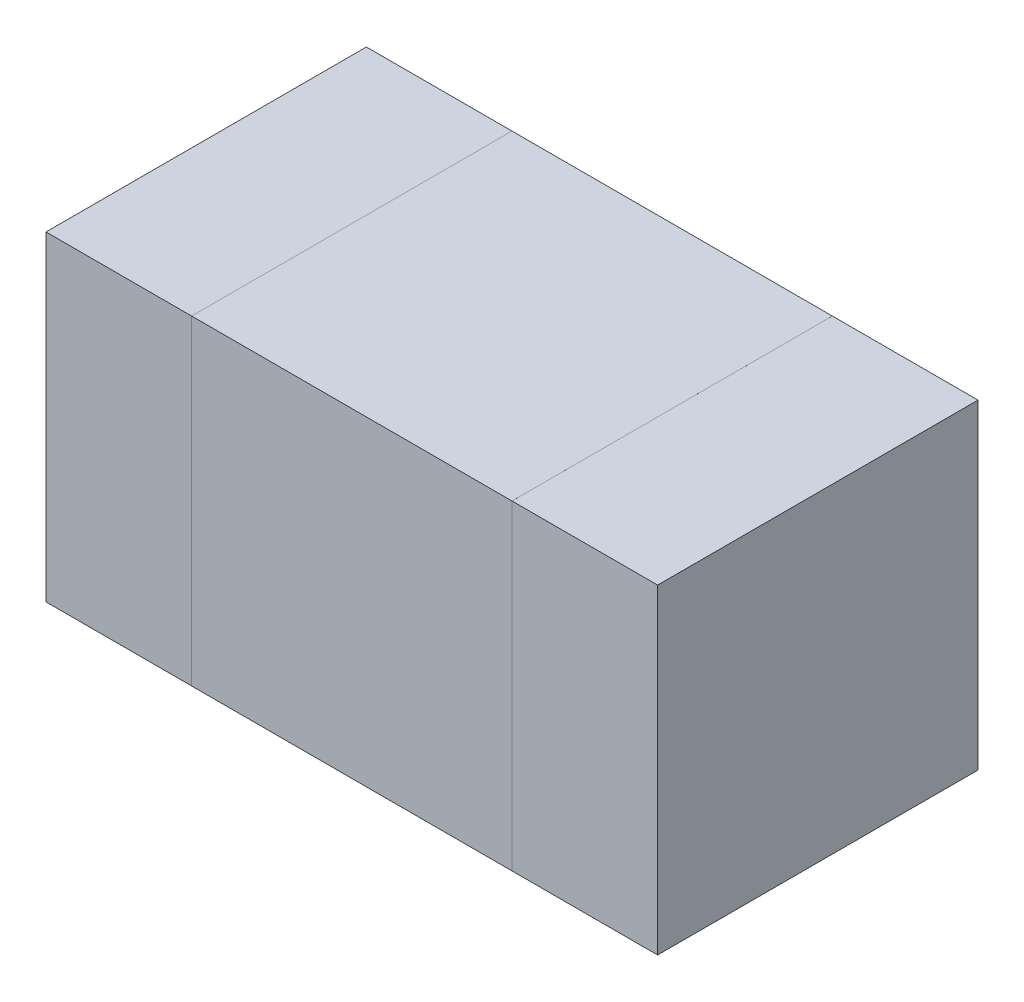
ISO-10303-21;
HEADER;
FILE_DESCRIPTION(('STEP AP214'),'2;1');
FILE_NAME('part.step','',(''),(''),'','','');
FILE_SCHEMA(('AUTOMOTIVE_DESIGN { 1 0 10303 214 1 1 1 1 }'));
ENDSEC;
DATA;
#1=APPLICATION_CONTEXT('core data for automotive mechanical design processes');
#2=APPLICATION_PROTOCOL_DEFINITION('international standard','automotive_design',2000,#1);
#3=PRODUCT_CONTEXT('',#1,'mechanical');
#4=PRODUCT('Part','Part','',(#3));
#5=PRODUCT_RELATED_PRODUCT_CATEGORY('part','',(#4));
#6=PRODUCT_DEFINITION_FORMATION('','',#4);
#7=PRODUCT_DEFINITION_CONTEXT('part definition',#1,'design');
#8=PRODUCT_DEFINITION('design','',#6,#7);
#9=PRODUCT_DEFINITION_SHAPE('','',#8);
#10=(LENGTH_UNIT() NAMED_UNIT(*) SI_UNIT(.MILLI.,.METRE.));
#11=(NAMED_UNIT(*) PLANE_ANGLE_UNIT() SI_UNIT($,.RADIAN.));
#12=(NAMED_UNIT(*) SI_UNIT($,.STERADIAN.) SOLID_ANGLE_UNIT());
#13=UNCERTAINTY_MEASURE_WITH_UNIT(LENGTH_MEASURE(1.E-05),#10,'distance_accuracy_value','');
#14=(GEOMETRIC_REPRESENTATION_CONTEXT(3) GLOBAL_UNCERTAINTY_ASSIGNED_CONTEXT((#13)) GLOBAL_UNIT_ASSIGNED_CONTEXT((#10,
#11,#12)) REPRESENTATION_CONTEXT('',''));
#15=CARTESIAN_POINT('',(0.,0.,0.));
#16=DIRECTION('',(0.,0.,1.));
#17=DIRECTION('',(1.,0.,0.));
#18=AXIS2_PLACEMENT_3D('',#15,#16,#17);
#19=CARTESIAN_POINT('',(1.000005241211,9.859997420195,0.32999934));
#20=DIRECTION('',(0.,0.,-1.));
#21=DIRECTION('',(0.,-1.,0.));
#22=AXIS2_PLACEMENT_3D('',#19,#20,#21);
#23=PLANE('',#22);
#24=DIRECTION('',(0.,1.,0.));
#25=VECTOR('',#24,1.);
#26=CARTESIAN_POINT('',(1.000005241211,9.859997420195,0.32999934));
#27=LINE('',#26,#25);
#28=CARTESIAN_POINT('',(1.000005241211,9.859997420195,0.32999934));
#29=VERTEX_POINT('',#28);
#30=CARTESIAN_POINT('',(1.000005241211,10.189999300195,0.32999934));
#31=VERTEX_POINT('',#30);
#32=EDGE_CURVE('P0_E82',#29,#31,#27,.T.);
#33=ORIENTED_EDGE('',*,*,#32,.T.);
#34=DIRECTION('',(-1.,0.,0.));
#35=VECTOR('',#34,1.);
#36=CARTESIAN_POINT('',(1.000005241211,10.189999300195,0.32999934));
#37=LINE('',#36,#35);
#38=CARTESIAN_POINT('',(0.850003001211,10.189999300195,0.32999934));
#39=VERTEX_POINT('',#38);
#40=EDGE_CURVE('P0_E105',#31,#39,#37,.T.);
#41=ORIENTED_EDGE('',*,*,#40,.T.);
#42=DIRECTION('',(0.,-1.,0.));
#43=VECTOR('',#42,1.);
#44=CARTESIAN_POINT('',(0.850003001211,10.189999300195,0.32999934));
#45=LINE('',#44,#43);
#46=CARTESIAN_POINT('',(0.850003001211,9.859997420195,0.32999934));
#47=VERTEX_POINT('',#46);
#48=EDGE_CURVE('P0_E75',#39,#47,#45,.T.);
#49=ORIENTED_EDGE('',*,*,#48,.T.);
#50=DIRECTION('',(1.,0.,0.));
#51=VECTOR('',#50,1.);
#52=CARTESIAN_POINT('',(0.850003001211,9.859997420195,0.32999934));
#53=LINE('',#52,#51);
#54=EDGE_CURVE('P0_E11',#47,#29,#53,.T.);
#55=ORIENTED_EDGE('',*,*,#54,.T.);
#56=EDGE_LOOP('',(#33,#41,#49,#55));
#57=FACE_BOUND('',#56,.T.);
#58=ADVANCED_FACE('P0_F17',(#57),#23,.F.);
#59=CARTESIAN_POINT('',(1.000005241211,9.859997420195,0.));
#60=DIRECTION('',(0.,0.,-1.));
#61=DIRECTION('',(0.,-1.,0.));
#62=AXIS2_PLACEMENT_3D('',#59,#60,#61);
#63=PLANE('',#62);
#64=DIRECTION('',(1.,0.,0.));
#65=VECTOR('',#64,1.);
#66=CARTESIAN_POINT('',(0.850003001211,9.859997420195,0.));
#67=LINE('',#66,#65);
#68=CARTESIAN_POINT('',(0.850003001211,9.859997420195,0.));
#69=VERTEX_POINT('',#68);
#70=CARTESIAN_POINT('',(1.000005241211,9.859997420195,0.));
#71=VERTEX_POINT('',#70);
#72=EDGE_CURVE('P0_E26',#69,#71,#67,.T.);
#73=ORIENTED_EDGE('',*,*,#72,.F.);
#74=DIRECTION('',(0.,-1.,0.));
#75=VECTOR('',#74,1.);
#76=CARTESIAN_POINT('',(0.850003001211,10.189999300195,0.));
#77=LINE('',#76,#75);
#78=CARTESIAN_POINT('',(0.850003001211,10.189999300195,0.));
#79=VERTEX_POINT('',#78);
#80=EDGE_CURVE('P0_E109',#79,#69,#77,.T.);
#81=ORIENTED_EDGE('',*,*,#80,.F.);
#82=DIRECTION('',(-1.,0.,0.));
#83=VECTOR('',#82,1.);
#84=CARTESIAN_POINT('',(1.000005241211,10.189999300195,0.));
#85=LINE('',#84,#83);
#86=CARTESIAN_POINT('',(1.000005241211,10.189999300195,0.));
#87=VERTEX_POINT('',#86);
#88=EDGE_CURVE('P0_E84',#87,#79,#85,.T.);
#89=ORIENTED_EDGE('',*,*,#88,.F.);
#90=DIRECTION('',(0.,1.,0.));
#91=VECTOR('',#90,1.);
#92=CARTESIAN_POINT('',(1.000005241211,9.859997420195,0.));
#93=LINE('',#92,#91);
#94=EDGE_CURVE('P0_E80',#71,#87,#93,.T.);
#95=ORIENTED_EDGE('',*,*,#94,.F.);
#96=EDGE_LOOP('',(#73,#81,#89,#95));
#97=FACE_BOUND('',#96,.T.);
#98=ADVANCED_FACE('P0_F19',(#97),#63,.T.);
#99=CARTESIAN_POINT('',(0.850003001211,9.859997420195,0.));
#100=DIRECTION('',(0.,1.,0.));
#101=DIRECTION('',(1.,0.,0.));
#102=AXIS2_PLACEMENT_3D('',#99,#100,#101);
#103=PLANE('',#102);
#104=ORIENTED_EDGE('',*,*,#72,.T.);
#105=DIRECTION('',(0.,0.,1.));
#106=VECTOR('',#105,1.);
#107=CARTESIAN_POINT('',(1.000005241211,9.859997420195,0.));
#108=LINE('',#107,#106);
#109=EDGE_CURVE('P0_E69',#71,#29,#108,.T.);
#110=ORIENTED_EDGE('',*,*,#109,.T.);
#111=ORIENTED_EDGE('',*,*,#54,.F.);
#112=DIRECTION('',(0.,0.,1.));
#113=VECTOR('',#112,1.);
#114=CARTESIAN_POINT('',(0.850003001211,9.859997420195,0.));
#115=LINE('',#114,#113);
#116=EDGE_CURVE('P0_E72',#69,#47,#115,.T.);
#117=ORIENTED_EDGE('',*,*,#116,.F.);
#118=EDGE_LOOP('',(#104,#110,#111,#117));
#119=FACE_BOUND('',#118,.T.);
#120=ADVANCED_FACE('P0_F68',(#119),#103,.F.);
#121=CARTESIAN_POINT('',(0.850003001211,10.189999300195,0.));
#122=DIRECTION('',(1.,0.,0.));
#123=DIRECTION('',(0.,1.,0.));
#124=AXIS2_PLACEMENT_3D('',#121,#122,#123);
#125=PLANE('',#124);
#126=ORIENTED_EDGE('',*,*,#80,.T.);
#127=ORIENTED_EDGE('',*,*,#116,.T.);
#128=ORIENTED_EDGE('',*,*,#48,.F.);
#129=DIRECTION('',(0.,0.,1.));
#130=VECTOR('',#129,1.);
#131=CARTESIAN_POINT('',(0.850003001211,10.189999300195,0.));
#132=LINE('',#131,#130);
#133=EDGE_CURVE('P0_E101',#79,#39,#132,.T.);
#134=ORIENTED_EDGE('',*,*,#133,.F.);
#135=EDGE_LOOP('',(#126,#127,#128,#134));
#136=FACE_BOUND('',#135,.T.);
#137=ADVANCED_FACE('P0_F116',(#136),#125,.F.);
#138=CARTESIAN_POINT('',(1.000005241211,10.189999300195,0.));
#139=DIRECTION('',(0.,-1.,0.));
#140=DIRECTION('',(0.,0.,-1.));
#141=AXIS2_PLACEMENT_3D('',#138,#139,#140);
#142=PLANE('',#141);
#143=ORIENTED_EDGE('',*,*,#88,.T.);
#144=ORIENTED_EDGE('',*,*,#133,.T.);
#145=ORIENTED_EDGE('',*,*,#40,.F.);
#146=DIRECTION('',(0.,0.,1.));
#147=VECTOR('',#146,1.);
#148=CARTESIAN_POINT('',(1.000005241211,10.189999300195,0.));
#149=LINE('',#148,#147);
#150=EDGE_CURVE('P0_E89',#87,#31,#149,.T.);
#151=ORIENTED_EDGE('',*,*,#150,.F.);
#152=EDGE_LOOP('',(#143,#144,#145,#151));
#153=FACE_BOUND('',#152,.T.);
#154=ADVANCED_FACE('P0_F118',(#153),#142,.F.);
#155=CARTESIAN_POINT('',(1.000005241211,9.859997420195,0.));
#156=DIRECTION('',(-1.,0.,0.));
#157=DIRECTION('',(0.,0.,1.));
#158=AXIS2_PLACEMENT_3D('',#155,#156,#157);
#159=PLANE('',#158);
#160=ORIENTED_EDGE('',*,*,#94,.T.);
#161=ORIENTED_EDGE('',*,*,#150,.T.);
#162=ORIENTED_EDGE('',*,*,#32,.F.);
#163=ORIENTED_EDGE('',*,*,#109,.F.);
#164=EDGE_LOOP('',(#160,#161,#162,#163));
#165=FACE_BOUND('',#164,.T.);
#166=ADVANCED_FACE('P0_F78',(#165),#159,.F.);
#167=CLOSED_SHELL('',(#58,#98,#120,#137,#154,#166));
#168=MANIFOLD_SOLID_BREP('P0_B1',#167);
#169=CARTESIAN_POINT('',(1.48000096875,9.859997420195,0.32999934));
#170=DIRECTION('',(0.,0.,-1.));
#171=DIRECTION('',(0.,-1.,0.));
#172=AXIS2_PLACEMENT_3D('',#169,#170,#171);
#173=PLANE('',#172);
#174=DIRECTION('',(0.,1.,0.));
#175=VECTOR('',#174,1.);
#176=CARTESIAN_POINT('',(1.48000096875,9.859997420195,0.32999934));
#177=LINE('',#176,#175);
#178=CARTESIAN_POINT('',(1.48000096875,9.859997420195,0.32999934));
#179=VERTEX_POINT('',#178);
#180=CARTESIAN_POINT('',(1.48000096875,10.189999300195,0.32999934));
#181=VERTEX_POINT('',#180);
#182=EDGE_CURVE('P1_E81',#179,#181,#177,.T.);
#183=ORIENTED_EDGE('',*,*,#182,.T.);
#184=DIRECTION('',(-1.,0.,0.));
#185=VECTOR('',#184,1.);
#186=CARTESIAN_POINT('',(1.48000096875,10.189999300195,0.32999934));
#187=LINE('',#186,#185);
#188=CARTESIAN_POINT('',(1.32999872875,10.189999300195,0.32999934));
#189=VERTEX_POINT('',#188);
#190=EDGE_CURVE('P1_E96',#181,#189,#187,.T.);
#191=ORIENTED_EDGE('',*,*,#190,.T.);
#192=DIRECTION('',(0.,-1.,0.));
#193=VECTOR('',#192,1.);
#194=CARTESIAN_POINT('',(1.32999872875,10.189999300195,0.32999934));
#195=LINE('',#194,#193);
#196=CARTESIAN_POINT('',(1.32999872875,9.859997420195,0.32999934));
#197=VERTEX_POINT('',#196);
#198=EDGE_CURVE('P1_E74',#189,#197,#195,.T.);
#199=ORIENTED_EDGE('',*,*,#198,.T.);
#200=DIRECTION('',(1.,0.,0.));
#201=VECTOR('',#200,1.);
#202=CARTESIAN_POINT('',(1.32999872875,9.859997420195,0.32999934));
#203=LINE('',#202,#201);
#204=EDGE_CURVE('P1_E11',#197,#179,#203,.T.);
#205=ORIENTED_EDGE('',*,*,#204,.T.);
#206=EDGE_LOOP('',(#183,#191,#199,#205));
#207=FACE_BOUND('',#206,.T.);
#208=ADVANCED_FACE('P1_F17',(#207),#173,.F.);
#209=CARTESIAN_POINT('',(1.48000096875,9.859997420195,0.));
#210=DIRECTION('',(0.,0.,-1.));
#211=DIRECTION('',(0.,-1.,0.));
#212=AXIS2_PLACEMENT_3D('',#209,#210,#211);
#213=PLANE('',#212);
#214=DIRECTION('',(1.,0.,0.));
#215=VECTOR('',#214,1.);
#216=CARTESIAN_POINT('',(1.32999872875,9.859997420195,0.));
#217=LINE('',#216,#215);
#218=CARTESIAN_POINT('',(1.32999872875,9.859997420195,0.));
#219=VERTEX_POINT('',#218);
#220=CARTESIAN_POINT('',(1.48000096875,9.859997420195,0.));
#221=VERTEX_POINT('',#220);
#222=EDGE_CURVE('P1_E25',#219,#221,#217,.T.);
#223=ORIENTED_EDGE('',*,*,#222,.F.);
#224=DIRECTION('',(0.,-1.,0.));
#225=VECTOR('',#224,1.);
#226=CARTESIAN_POINT('',(1.32999872875,10.189999300195,0.));
#227=LINE('',#226,#225);
#228=CARTESIAN_POINT('',(1.32999872875,10.189999300195,0.));
#229=VERTEX_POINT('',#228);
#230=EDGE_CURVE('P1_E108',#229,#219,#227,.T.);
#231=ORIENTED_EDGE('',*,*,#230,.F.);
#232=DIRECTION('',(-1.,0.,0.));
#233=VECTOR('',#232,1.);
#234=CARTESIAN_POINT('',(1.48000096875,10.189999300195,0.));
#235=LINE('',#234,#233);
#236=CARTESIAN_POINT('',(1.48000096875,10.189999300195,0.));
#237=VERTEX_POINT('',#236);
#238=EDGE_CURVE('P1_E83',#237,#229,#235,.T.);
#239=ORIENTED_EDGE('',*,*,#238,.F.);
#240=DIRECTION('',(0.,1.,0.));
#241=VECTOR('',#240,1.);
#242=CARTESIAN_POINT('',(1.48000096875,9.859997420195,0.));
#243=LINE('',#242,#241);
#244=EDGE_CURVE('P1_E79',#221,#237,#243,.T.);
#245=ORIENTED_EDGE('',*,*,#244,.F.);
#246=EDGE_LOOP('',(#223,#231,#239,#245));
#247=FACE_BOUND('',#246,.T.);
#248=ADVANCED_FACE('P1_F85',(#247),#213,.T.);
#249=CARTESIAN_POINT('',(1.32999872875,9.859997420195,0.));
#250=DIRECTION('',(0.,1.,0.));
#251=DIRECTION('',(1.,0.,0.));
#252=AXIS2_PLACEMENT_3D('',#249,#250,#251);
#253=PLANE('',#252);
#254=ORIENTED_EDGE('',*,*,#222,.T.);
#255=DIRECTION('',(0.,0.,1.));
#256=VECTOR('',#255,1.);
#257=CARTESIAN_POINT('',(1.48000096875,9.859997420195,0.));
#258=LINE('',#257,#256);
#259=EDGE_CURVE('P1_E68',#221,#179,#258,.T.);
#260=ORIENTED_EDGE('',*,*,#259,.T.);
#261=ORIENTED_EDGE('',*,*,#204,.F.);
#262=DIRECTION('',(0.,0.,1.));
#263=VECTOR('',#262,1.);
#264=CARTESIAN_POINT('',(1.32999872875,9.859997420195,0.));
#265=LINE('',#264,#263);
#266=EDGE_CURVE('P1_E71',#219,#197,#265,.T.);
#267=ORIENTED_EDGE('',*,*,#266,.F.);
#268=EDGE_LOOP('',(#254,#260,#261,#267));
#269=FACE_BOUND('',#268,.T.);
#270=ADVANCED_FACE('P1_F67',(#269),#253,.F.);
#271=CARTESIAN_POINT('',(1.32999872875,10.189999300195,0.));
#272=DIRECTION('',(1.,0.,0.));
#273=DIRECTION('',(0.,1.,0.));
#274=AXIS2_PLACEMENT_3D('',#271,#272,#273);
#275=PLANE('',#274);
#276=ORIENTED_EDGE('',*,*,#230,.T.);
#277=ORIENTED_EDGE('',*,*,#266,.T.);
#278=ORIENTED_EDGE('',*,*,#198,.F.);
#279=DIRECTION('',(0.,0.,1.));
#280=VECTOR('',#279,1.);
#281=CARTESIAN_POINT('',(1.32999872875,10.189999300195,0.));
#282=LINE('',#281,#280);
#283=EDGE_CURVE('P1_E104',#229,#189,#282,.T.);
#284=ORIENTED_EDGE('',*,*,#283,.F.);
#285=EDGE_LOOP('',(#276,#277,#278,#284));
#286=FACE_BOUND('',#285,.T.);
#287=ADVANCED_FACE('P1_F114',(#286),#275,.F.);
#288=CARTESIAN_POINT('',(1.48000096875,10.189999300195,0.));
#289=DIRECTION('',(0.,-1.,0.));
#290=DIRECTION('',(0.,0.,-1.));
#291=AXIS2_PLACEMENT_3D('',#288,#289,#290);
#292=PLANE('',#291);
#293=ORIENTED_EDGE('',*,*,#238,.T.);
#294=ORIENTED_EDGE('',*,*,#283,.T.);
#295=ORIENTED_EDGE('',*,*,#190,.F.);
#296=DIRECTION('',(0.,0.,1.));
#297=VECTOR('',#296,1.);
#298=CARTESIAN_POINT('',(1.48000096875,10.189999300195,0.));
#299=LINE('',#298,#297);
#300=EDGE_CURVE('P1_E89',#237,#181,#299,.T.);
#301=ORIENTED_EDGE('',*,*,#300,.F.);
#302=EDGE_LOOP('',(#293,#294,#295,#301));
#303=FACE_BOUND('',#302,.T.);
#304=ADVANCED_FACE('P1_F118',(#303),#292,.F.);
#305=CARTESIAN_POINT('',(1.48000096875,9.859997420195,0.));
#306=DIRECTION('',(-1.,0.,0.));
#307=DIRECTION('',(0.,0.,1.));
#308=AXIS2_PLACEMENT_3D('',#305,#306,#307);
#309=PLANE('',#308);
#310=ORIENTED_EDGE('',*,*,#244,.T.);
#311=ORIENTED_EDGE('',*,*,#300,.T.);
#312=ORIENTED_EDGE('',*,*,#182,.F.);
#313=ORIENTED_EDGE('',*,*,#259,.F.);
#314=EDGE_LOOP('',(#310,#311,#312,#313));
#315=FACE_BOUND('',#314,.T.);
#316=ADVANCED_FACE('P1_F77',(#315),#309,.F.);
#317=CLOSED_SHELL('',(#208,#248,#270,#287,#304,#316));
#318=MANIFOLD_SOLID_BREP('P1_B1',#317);
#319=CARTESIAN_POINT('',(0.999993415586,9.859999960195,0.32999934));
#320=DIRECTION('',(0.,0.,-1.));
#321=DIRECTION('',(0.,-1.,0.));
#322=AXIS2_PLACEMENT_3D('',#319,#320,#321);
#323=PLANE('',#322);
#324=DIRECTION('',(1.,0.,0.));
#325=VECTOR('',#324,1.);
#326=CARTESIAN_POINT('',(0.999993415586,9.859999960195,0.32999934));
#327=LINE('',#326,#325);
#328=CARTESIAN_POINT('',(0.999993415586,9.859999960195,0.32999934));
#329=VERTEX_POINT('',#328);
#330=CARTESIAN_POINT('',(1.329995295586,9.859999960195,0.32999934));
#331=VERTEX_POINT('',#330);
#332=EDGE_CURVE('P2_E90',#329,#331,#327,.T.);
#333=ORIENTED_EDGE('',*,*,#332,.T.);
#334=DIRECTION('',(0.,1.,0.));
#335=VECTOR('',#334,1.);
#336=CARTESIAN_POINT('',(1.329995295586,9.859999960195,0.32999934));
#337=LINE('',#336,#335);
#338=CARTESIAN_POINT('',(1.329995295586,10.189999300195,0.32999934));
#339=VERTEX_POINT('',#338);
#340=EDGE_CURVE('P2_E85',#331,#339,#337,.T.);
#341=ORIENTED_EDGE('',*,*,#340,.T.);
#342=DIRECTION('',(-1.,0.,0.));
#343=VECTOR('',#342,1.);
#344=CARTESIAN_POINT('',(1.329995295586,10.189999300195,0.32999934));
#345=LINE('',#344,#343);
#346=CARTESIAN_POINT('',(0.999993415586,10.189999300195,0.32999934));
#347=VERTEX_POINT('',#346);
#348=EDGE_CURVE('P2_E112',#339,#347,#345,.T.);
#349=ORIENTED_EDGE('',*,*,#348,.T.);
#350=DIRECTION('',(0.,-1.,0.));
#351=VECTOR('',#350,1.);
#352=CARTESIAN_POINT('',(0.999993415586,10.189999300195,0.32999934));
#353=LINE('',#352,#351);
#354=EDGE_CURVE('P2_E11',#347,#329,#353,.T.);
#355=ORIENTED_EDGE('',*,*,#354,.T.);
#356=EDGE_LOOP('',(#333,#341,#349,#355));
#357=FACE_BOUND('',#356,.T.);
#358=ADVANCED_FACE('P2_F17',(#357),#323,.F.);
#359=CARTESIAN_POINT('',(0.999993415586,9.859999960195,0.));
#360=DIRECTION('',(0.,0.,-1.));
#361=DIRECTION('',(0.,-1.,0.));
#362=AXIS2_PLACEMENT_3D('',#359,#360,#361);
#363=PLANE('',#362);
#364=DIRECTION('',(0.,-1.,0.));
#365=VECTOR('',#364,1.);
#366=CARTESIAN_POINT('',(0.999993415586,10.189999300195,0.));
#367=LINE('',#366,#365);
#368=CARTESIAN_POINT('',(0.999993415586,10.189999300195,0.));
#369=VERTEX_POINT('',#368);
#370=CARTESIAN_POINT('',(0.999993415586,9.859999960195,0.));
#371=VERTEX_POINT('',#370);
#372=EDGE_CURVE('P2_E25',#369,#371,#367,.T.);
#373=ORIENTED_EDGE('',*,*,#372,.F.);
#374=DIRECTION('',(-1.,0.,0.));
#375=VECTOR('',#374,1.);
#376=CARTESIAN_POINT('',(1.329995295586,10.189999300195,0.));
#377=LINE('',#376,#375);
#378=CARTESIAN_POINT('',(1.329995295586,10.189999300195,0.));
#379=VERTEX_POINT('',#378);
#380=EDGE_CURVE('P2_E73',#379,#369,#377,.T.);
#381=ORIENTED_EDGE('',*,*,#380,.F.);
#382=DIRECTION('',(0.,1.,0.));
#383=VECTOR('',#382,1.);
#384=CARTESIAN_POINT('',(1.329995295586,9.859999960195,0.));
#385=LINE('',#384,#383);
#386=CARTESIAN_POINT('',(1.329995295586,9.859999960195,0.));
#387=VERTEX_POINT('',#386);
#388=EDGE_CURVE('P2_E67',#387,#379,#385,.T.);
#389=ORIENTED_EDGE('',*,*,#388,.F.);
#390=DIRECTION('',(1.,0.,0.));
#391=VECTOR('',#390,1.);
#392=CARTESIAN_POINT('',(0.999993415586,9.859999960195,0.));
#393=LINE('',#392,#391);
#394=EDGE_CURVE('P2_E71',#371,#387,#393,.T.);
#395=ORIENTED_EDGE('',*,*,#394,.F.);
#396=EDGE_LOOP('',(#373,#381,#389,#395));
#397=FACE_BOUND('',#396,.T.);
#398=ADVANCED_FACE('P2_F69',(#397),#363,.T.);
#399=CARTESIAN_POINT('',(0.999993415586,10.189999300195,0.));
#400=DIRECTION('',(1.,0.,0.));
#401=DIRECTION('',(0.,1.,0.));
#402=AXIS2_PLACEMENT_3D('',#399,#400,#401);
#403=PLANE('',#402);
#404=ORIENTED_EDGE('',*,*,#372,.T.);
#405=DIRECTION('',(0.,0.,1.));
#406=VECTOR('',#405,1.);
#407=CARTESIAN_POINT('',(0.999993415586,9.859999960195,0.));
#408=LINE('',#407,#406);
#409=EDGE_CURVE('P2_E79',#371,#329,#408,.T.);
#410=ORIENTED_EDGE('',*,*,#409,.T.);
#411=ORIENTED_EDGE('',*,*,#354,.F.);
#412=DIRECTION('',(0.,0.,1.));
#413=VECTOR('',#412,1.);
#414=CARTESIAN_POINT('',(0.999993415586,10.189999300195,0.));
#415=LINE('',#414,#413);
#416=EDGE_CURVE('P2_E108',#369,#347,#415,.T.);
#417=ORIENTED_EDGE('',*,*,#416,.F.);
#418=EDGE_LOOP('',(#404,#410,#411,#417));
#419=FACE_BOUND('',#418,.T.);
#420=ADVANCED_FACE('P2_F119',(#419),#403,.F.);
#421=CARTESIAN_POINT('',(1.329995295586,10.189999300195,0.));
#422=DIRECTION('',(0.,-1.,0.));
#423=DIRECTION('',(0.,0.,-1.));
#424=AXIS2_PLACEMENT_3D('',#421,#422,#423);
#425=PLANE('',#424);
#426=ORIENTED_EDGE('',*,*,#380,.T.);
#427=ORIENTED_EDGE('',*,*,#416,.T.);
#428=ORIENTED_EDGE('',*,*,#348,.F.);
#429=DIRECTION('',(0.,0.,1.));
#430=VECTOR('',#429,1.);
#431=CARTESIAN_POINT('',(1.329995295586,10.189999300195,0.));
#432=LINE('',#431,#430);
#433=EDGE_CURVE('P2_E78',#379,#339,#432,.T.);
#434=ORIENTED_EDGE('',*,*,#433,.F.);
#435=EDGE_LOOP('',(#426,#427,#428,#434));
#436=FACE_BOUND('',#435,.T.);
#437=ADVANCED_FACE('P2_F118',(#436),#425,.F.);
#438=CARTESIAN_POINT('',(1.329995295586,9.859999960195,0.));
#439=DIRECTION('',(-1.,0.,0.));
#440=DIRECTION('',(0.,0.,1.));
#441=AXIS2_PLACEMENT_3D('',#438,#439,#440);
#442=PLANE('',#441);
#443=ORIENTED_EDGE('',*,*,#388,.T.);
#444=ORIENTED_EDGE('',*,*,#433,.T.);
#445=ORIENTED_EDGE('',*,*,#340,.F.);
#446=DIRECTION('',(0.,0.,1.));
#447=VECTOR('',#446,1.);
#448=CARTESIAN_POINT('',(1.329995295586,9.859999960195,0.));
#449=LINE('',#448,#447);
#450=EDGE_CURVE('P2_E82',#387,#331,#449,.T.);
#451=ORIENTED_EDGE('',*,*,#450,.F.);
#452=EDGE_LOOP('',(#443,#444,#445,#451));
#453=FACE_BOUND('',#452,.T.);
#454=ADVANCED_FACE('P2_F83',(#453),#442,.F.);
#455=CARTESIAN_POINT('',(0.999993415586,9.859999960195,0.));
#456=DIRECTION('',(0.,1.,0.));
#457=DIRECTION('',(1.,0.,0.));
#458=AXIS2_PLACEMENT_3D('',#455,#456,#457);
#459=PLANE('',#458);
#460=ORIENTED_EDGE('',*,*,#394,.T.);
#461=ORIENTED_EDGE('',*,*,#450,.T.);
#462=ORIENTED_EDGE('',*,*,#332,.F.);
#463=ORIENTED_EDGE('',*,*,#409,.F.);
#464=EDGE_LOOP('',(#460,#461,#462,#463));
#465=FACE_BOUND('',#464,.T.);
#466=ADVANCED_FACE('P2_F93',(#465),#459,.F.);
#467=CLOSED_SHELL('',(#358,#398,#420,#437,#454,#466));
#468=MANIFOLD_SOLID_BREP('P2_B1',#467);
#469=ADVANCED_BREP_SHAPE_REPRESENTATION('',(#18,#168,#318,#468),#14);
#470=SHAPE_DEFINITION_REPRESENTATION(#9,#469);
ENDSEC;
END-ISO-10303-21;
